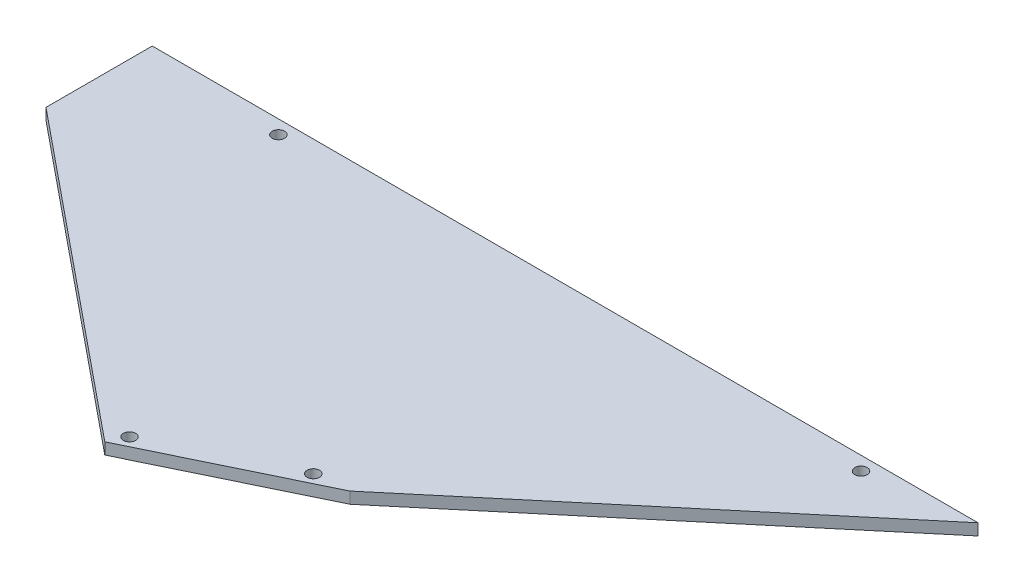
ISO-10303-21;
HEADER;
FILE_DESCRIPTION(('STEP AP214'),'2;1');
FILE_NAME('part.step','',(''),(''),'','','');
FILE_SCHEMA(('AUTOMOTIVE_DESIGN { 1 0 10303 214 1 1 1 1 }'));
ENDSEC;
DATA;
#1=APPLICATION_CONTEXT('core data for automotive mechanical design processes');
#2=APPLICATION_PROTOCOL_DEFINITION('international standard','automotive_design',2000,#1);
#3=PRODUCT_CONTEXT('',#1,'mechanical');
#4=PRODUCT('Part','Part','',(#3));
#5=PRODUCT_RELATED_PRODUCT_CATEGORY('part','',(#4));
#6=PRODUCT_DEFINITION_FORMATION('','',#4);
#7=PRODUCT_DEFINITION_CONTEXT('part definition',#1,'design');
#8=PRODUCT_DEFINITION('design','',#6,#7);
#9=PRODUCT_DEFINITION_SHAPE('','',#8);
#10=(LENGTH_UNIT() NAMED_UNIT(*) SI_UNIT(.MILLI.,.METRE.));
#11=(NAMED_UNIT(*) PLANE_ANGLE_UNIT() SI_UNIT($,.RADIAN.));
#12=(NAMED_UNIT(*) SI_UNIT($,.STERADIAN.) SOLID_ANGLE_UNIT());
#13=UNCERTAINTY_MEASURE_WITH_UNIT(LENGTH_MEASURE(1.E-05),#10,'distance_accuracy_value','');
#14=(GEOMETRIC_REPRESENTATION_CONTEXT(3) GLOBAL_UNCERTAINTY_ASSIGNED_CONTEXT((#13)) GLOBAL_UNIT_ASSIGNED_CONTEXT((#10,
#11,#12)) REPRESENTATION_CONTEXT('',''));
#15=CARTESIAN_POINT('',(0.,0.,0.));
#16=DIRECTION('',(0.,0.,1.));
#17=DIRECTION('',(1.,0.,0.));
#18=AXIS2_PLACEMENT_3D('',#15,#16,#17);
#19=CARTESIAN_POINT('',(0.,6.35,0.));
#20=DIRECTION('',(0.,-1.,0.));
#21=DIRECTION('',(0.,0.,-1.));
#22=AXIS2_PLACEMENT_3D('',#19,#20,#21);
#23=PLANE('',#22);
#24=DIRECTION('',(0.766044443118981,0.,-0.642787609686535));
#25=VECTOR('',#24,1.);
#26=CARTESIAN_POINT('',(-189.093207010109,6.35,158.66804026031));
#27=LINE('',#26,#25);
#28=CARTESIAN_POINT('',(-189.093207010109,6.35,158.66804026031));
#29=VERTEX_POINT('',#28);
#30=CARTESIAN_POINT('',(0.,6.35,0.));
#31=VERTEX_POINT('',#30);
#32=EDGE_CURVE('E136',#29,#31,#27,.T.);
#33=ORIENTED_EDGE('',*,*,#32,.T.);
#34=DIRECTION('',(-1.,0.,0.));
#35=VECTOR('',#34,1.);
#36=CARTESIAN_POINT('',(0.,6.35,0.));
#37=LINE('',#36,#35);
#38=CARTESIAN_POINT('',(-457.2,6.35,0.));
#39=VERTEX_POINT('',#38);
#40=EDGE_CURVE('E90',#31,#39,#37,.T.);
#41=ORIENTED_EDGE('',*,*,#40,.T.);
#42=DIRECTION('',(0.,0.,1.));
#43=VECTOR('',#42,1.);
#44=CARTESIAN_POINT('',(-457.2,6.35,58.8227919457594));
#45=LINE('',#44,#43);
#46=CARTESIAN_POINT('',(-457.2,6.35,58.8227919457594));
#47=VERTEX_POINT('',#46);
#48=EDGE_CURVE('E94',#39,#47,#45,.T.);
#49=ORIENTED_EDGE('',*,*,#48,.T.);
#50=DIRECTION('',(0.774894485136974,0.,0.632090608144358));
#51=VECTOR('',#50,1.);
#52=CARTESIAN_POINT('',(-457.2,6.35,58.8227919457594));
#53=LINE('',#52,#51);
#54=CARTESIAN_POINT('',(-280.55117869575,6.35,202.917327431388));
#55=VERTEX_POINT('',#54);
#56=EDGE_CURVE('E98',#47,#55,#53,.T.);
#57=ORIENTED_EDGE('',*,*,#56,.T.);
#58=DIRECTION('',(0.900176886669692,0.,-0.435524480030297));
#59=VECTOR('',#58,1.);
#60=CARTESIAN_POINT('',(-189.093207010109,6.35,158.66804026031));
#61=LINE('',#60,#59);
#62=EDGE_CURVE('E56',#55,#29,#61,.T.);
#63=ORIENTED_EDGE('',*,*,#62,.T.);
#64=EDGE_LOOP('',(#33,#41,#49,#57,#63));
#65=FACE_BOUND('',#64,.T.);
#66=CARTESIAN_POINT('',(-207.494657953148,6.35,160.516879503369));
#67=DIRECTION('',(0.,1.,0.));
#68=DIRECTION('',(0.,0.,1.));
#69=AXIS2_PLACEMENT_3D('',#66,#67,#68);
#70=CIRCLE('',#69,3.42900000000095);
#71=CARTESIAN_POINT('',(-207.494657953148,6.35,163.94587950337));
#72=VERTEX_POINT('',#71);
#73=EDGE_CURVE('E125',#72,#72,#70,.T.);
#74=ORIENTED_EDGE('',*,*,#73,.F.);
#75=EDGE_LOOP('',(#74));
#76=FACE_BOUND('',#75,.T.);
#77=CARTESIAN_POINT('',(-276.088136717378,6.35,193.703844881678));
#78=DIRECTION('',(0.,1.,0.));
#79=DIRECTION('',(0.,0.,1.));
#80=AXIS2_PLACEMENT_3D('',#77,#78,#79);
#81=CIRCLE('',#80,3.42900000000081);
#82=CARTESIAN_POINT('',(-276.088136717378,6.35,197.132844881679));
#83=VERTEX_POINT('',#82);
#84=EDGE_CURVE('E135',#83,#83,#81,.T.);
#85=ORIENTED_EDGE('',*,*,#84,.F.);
#86=EDGE_LOOP('',(#85));
#87=FACE_BOUND('',#86,.T.);
#88=CARTESIAN_POINT('',(-57.15,6.35,7.62000000000005));
#89=DIRECTION('',(0.,1.,0.));
#90=DIRECTION('',(0.,0.,1.));
#91=AXIS2_PLACEMENT_3D('',#88,#89,#90);
#92=CIRCLE('',#91,3.429);
#93=CARTESIAN_POINT('',(-57.15,6.35,11.0490000000001));
#94=VERTEX_POINT('',#93);
#95=EDGE_CURVE('E199',#94,#94,#92,.T.);
#96=ORIENTED_EDGE('',*,*,#95,.F.);
#97=EDGE_LOOP('',(#96));
#98=FACE_BOUND('',#97,.T.);
#99=CARTESIAN_POINT('',(-379.73,6.35,7.62000000000005));
#100=DIRECTION('',(0.,1.,0.));
#101=DIRECTION('',(0.,0.,1.));
#102=AXIS2_PLACEMENT_3D('',#99,#100,#101);
#103=CIRCLE('',#102,3.429);
#104=CARTESIAN_POINT('',(-379.73,6.35,11.0490000000001));
#105=VERTEX_POINT('',#104);
#106=EDGE_CURVE('E190',#105,#105,#103,.T.);
#107=ORIENTED_EDGE('',*,*,#106,.F.);
#108=EDGE_LOOP('',(#107));
#109=FACE_BOUND('',#108,.T.);
#110=ADVANCED_FACE('F39',(#65,#76,#87,#98,#109),#23,.F.);
#111=CARTESIAN_POINT('',(0.,0.,0.));
#112=DIRECTION('',(0.,-1.,0.));
#113=DIRECTION('',(0.,0.,-1.));
#114=AXIS2_PLACEMENT_3D('',#111,#112,#113);
#115=PLANE('',#114);
#116=CARTESIAN_POINT('',(-57.15,0.,7.62000000000005));
#117=DIRECTION('',(0.,1.,0.));
#118=DIRECTION('',(0.,0.,1.));
#119=AXIS2_PLACEMENT_3D('',#116,#117,#118);
#120=CIRCLE('',#119,3.429);
#121=CARTESIAN_POINT('',(-57.15,0.,11.0490000000001));
#122=VERTEX_POINT('',#121);
#123=EDGE_CURVE('E196',#122,#122,#120,.T.);
#124=ORIENTED_EDGE('',*,*,#123,.T.);
#125=EDGE_LOOP('',(#124));
#126=FACE_BOUND('',#125,.T.);
#127=CARTESIAN_POINT('',(-207.494657953148,0.,160.516879503369));
#128=DIRECTION('',(0.,1.,0.));
#129=DIRECTION('',(0.,0.,1.));
#130=AXIS2_PLACEMENT_3D('',#127,#128,#129);
#131=CIRCLE('',#130,3.42900000000095);
#132=CARTESIAN_POINT('',(-207.494657953148,0.,163.94587950337));
#133=VERTEX_POINT('',#132);
#134=EDGE_CURVE('E131',#133,#133,#131,.T.);
#135=ORIENTED_EDGE('',*,*,#134,.T.);
#136=EDGE_LOOP('',(#135));
#137=FACE_BOUND('',#136,.T.);
#138=DIRECTION('',(0.766044443118981,0.,-0.642787609686535));
#139=VECTOR('',#138,1.);
#140=CARTESIAN_POINT('',(-189.093207010109,0.,158.66804026031));
#141=LINE('',#140,#139);
#142=CARTESIAN_POINT('',(-189.093207010109,0.,158.66804026031));
#143=VERTEX_POINT('',#142);
#144=CARTESIAN_POINT('',(0.,0.,0.));
#145=VERTEX_POINT('',#144);
#146=EDGE_CURVE('E130',#143,#145,#141,.T.);
#147=ORIENTED_EDGE('',*,*,#146,.F.);
#148=DIRECTION('',(0.900176886669692,0.,-0.435524480030297));
#149=VECTOR('',#148,1.);
#150=CARTESIAN_POINT('',(-189.093207010109,0.,158.66804026031));
#151=LINE('',#150,#149);
#152=CARTESIAN_POINT('',(-280.55117869575,0.,202.917327431388));
#153=VERTEX_POINT('',#152);
#154=EDGE_CURVE('E82',#153,#143,#151,.T.);
#155=ORIENTED_EDGE('',*,*,#154,.F.);
#156=DIRECTION('',(0.774894485136974,0.,0.632090608144358));
#157=VECTOR('',#156,1.);
#158=CARTESIAN_POINT('',(-457.2,0.,58.8227919457594));
#159=LINE('',#158,#157);
#160=CARTESIAN_POINT('',(-457.2,0.,58.8227919457594));
#161=VERTEX_POINT('',#160);
#162=EDGE_CURVE('E76',#161,#153,#159,.T.);
#163=ORIENTED_EDGE('',*,*,#162,.F.);
#164=DIRECTION('',(0.,0.,1.));
#165=VECTOR('',#164,1.);
#166=CARTESIAN_POINT('',(-457.2,0.,58.8227919457594));
#167=LINE('',#166,#165);
#168=CARTESIAN_POINT('',(-457.2,0.,0.));
#169=VERTEX_POINT('',#168);
#170=EDGE_CURVE('E105',#169,#161,#167,.T.);
#171=ORIENTED_EDGE('',*,*,#170,.F.);
#172=DIRECTION('',(-1.,0.,0.));
#173=VECTOR('',#172,1.);
#174=CARTESIAN_POINT('',(0.,0.,0.));
#175=LINE('',#174,#173);
#176=EDGE_CURVE('E151',#145,#169,#175,.T.);
#177=ORIENTED_EDGE('',*,*,#176,.F.);
#178=EDGE_LOOP('',(#147,#155,#163,#171,#177));
#179=FACE_BOUND('',#178,.T.);
#180=CARTESIAN_POINT('',(-276.088136717378,0.,193.703844881678));
#181=DIRECTION('',(0.,1.,0.));
#182=DIRECTION('',(0.,0.,1.));
#183=AXIS2_PLACEMENT_3D('',#180,#181,#182);
#184=CIRCLE('',#183,3.42900000000081);
#185=CARTESIAN_POINT('',(-276.088136717378,0.,197.132844881679));
#186=VERTEX_POINT('',#185);
#187=EDGE_CURVE('E132',#186,#186,#184,.T.);
#188=ORIENTED_EDGE('',*,*,#187,.T.);
#189=EDGE_LOOP('',(#188));
#190=FACE_BOUND('',#189,.T.);
#191=CARTESIAN_POINT('',(-379.73,0.,7.62000000000005));
#192=DIRECTION('',(0.,1.,0.));
#193=DIRECTION('',(0.,0.,1.));
#194=AXIS2_PLACEMENT_3D('',#191,#192,#193);
#195=CIRCLE('',#194,3.429);
#196=CARTESIAN_POINT('',(-379.73,0.,11.0490000000001));
#197=VERTEX_POINT('',#196);
#198=EDGE_CURVE('E193',#197,#197,#195,.T.);
#199=ORIENTED_EDGE('',*,*,#198,.T.);
#200=EDGE_LOOP('',(#199));
#201=FACE_BOUND('',#200,.T.);
#202=ADVANCED_FACE('F149',(#126,#137,#179,#190,#201),#115,.T.);
#203=CARTESIAN_POINT('',(-189.093207010109,6.35,158.66804026031));
#204=DIRECTION('',(-0.642787609686535,0.,-0.766044443118982));
#205=DIRECTION('',(-0.766044443118982,0.,0.642787609686535));
#206=AXIS2_PLACEMENT_3D('',#203,#204,#205);
#207=PLANE('',#206);
#208=ORIENTED_EDGE('',*,*,#146,.T.);
#209=DIRECTION('',(0.,-1.,0.));
#210=VECTOR('',#209,1.);
#211=CARTESIAN_POINT('',(0.,6.35,0.));
#212=LINE('',#211,#210);
#213=EDGE_CURVE('E12',#31,#145,#212,.T.);
#214=ORIENTED_EDGE('',*,*,#213,.F.);
#215=ORIENTED_EDGE('',*,*,#32,.F.);
#216=DIRECTION('',(0.,-1.,0.));
#217=VECTOR('',#216,1.);
#218=CARTESIAN_POINT('',(-189.093207010109,6.35,158.66804026031));
#219=LINE('',#218,#217);
#220=EDGE_CURVE('E110',#29,#143,#219,.T.);
#221=ORIENTED_EDGE('',*,*,#220,.T.);
#222=EDGE_LOOP('',(#208,#214,#215,#221));
#223=FACE_BOUND('',#222,.T.);
#224=ADVANCED_FACE('F41',(#223),#207,.F.);
#225=CARTESIAN_POINT('',(0.,6.35,0.));
#226=DIRECTION('',(0.,0.,1.));
#227=DIRECTION('',(1.,0.,0.));
#228=AXIS2_PLACEMENT_3D('',#225,#226,#227);
#229=PLANE('',#228);
#230=ORIENTED_EDGE('',*,*,#176,.T.);
#231=DIRECTION('',(0.,-1.,0.));
#232=VECTOR('',#231,1.);
#233=CARTESIAN_POINT('',(-457.2,6.35,0.));
#234=LINE('',#233,#232);
#235=EDGE_CURVE('E48',#39,#169,#234,.T.);
#236=ORIENTED_EDGE('',*,*,#235,.F.);
#237=ORIENTED_EDGE('',*,*,#40,.F.);
#238=ORIENTED_EDGE('',*,*,#213,.T.);
#239=EDGE_LOOP('',(#230,#236,#237,#238));
#240=FACE_BOUND('',#239,.T.);
#241=ADVANCED_FACE('F250',(#240),#229,.F.);
#242=CARTESIAN_POINT('',(-457.2,6.35,58.8227919457594));
#243=DIRECTION('',(1.,0.,0.));
#244=DIRECTION('',(0.,0.,-1.));
#245=AXIS2_PLACEMENT_3D('',#242,#243,#244);
#246=PLANE('',#245);
#247=ORIENTED_EDGE('',*,*,#170,.T.);
#248=DIRECTION('',(0.,-1.,0.));
#249=VECTOR('',#248,1.);
#250=CARTESIAN_POINT('',(-457.2,6.35,58.8227919457594));
#251=LINE('',#250,#249);
#252=EDGE_CURVE('E102',#47,#161,#251,.T.);
#253=ORIENTED_EDGE('',*,*,#252,.F.);
#254=ORIENTED_EDGE('',*,*,#48,.F.);
#255=ORIENTED_EDGE('',*,*,#235,.T.);
#256=EDGE_LOOP('',(#247,#253,#254,#255));
#257=FACE_BOUND('',#256,.T.);
#258=ADVANCED_FACE('F103',(#257),#246,.F.);
#259=CARTESIAN_POINT('',(-457.2,6.35,58.8227919457594));
#260=DIRECTION('',(0.632090608144358,0.,-0.774894485136973));
#261=DIRECTION('',(-0.774894485136974,0.,-0.632090608144358));
#262=AXIS2_PLACEMENT_3D('',#259,#260,#261);
#263=PLANE('',#262);
#264=ORIENTED_EDGE('',*,*,#162,.T.);
#265=DIRECTION('',(0.,-1.,0.));
#266=VECTOR('',#265,1.);
#267=CARTESIAN_POINT('',(-280.55117869575,6.35,202.917327431388));
#268=LINE('',#267,#266);
#269=EDGE_CURVE('E106',#55,#153,#268,.T.);
#270=ORIENTED_EDGE('',*,*,#269,.F.);
#271=ORIENTED_EDGE('',*,*,#56,.F.);
#272=ORIENTED_EDGE('',*,*,#252,.T.);
#273=EDGE_LOOP('',(#264,#270,#271,#272));
#274=FACE_BOUND('',#273,.T.);
#275=ADVANCED_FACE('F108',(#274),#263,.F.);
#276=CARTESIAN_POINT('',(-189.093207010109,6.35,158.66804026031));
#277=DIRECTION('',(-0.435524480030297,0.,-0.900176886669692));
#278=DIRECTION('',(-0.900176886669692,0.,0.435524480030297));
#279=AXIS2_PLACEMENT_3D('',#276,#277,#278);
#280=PLANE('',#279);
#281=ORIENTED_EDGE('',*,*,#154,.T.);
#282=ORIENTED_EDGE('',*,*,#220,.F.);
#283=ORIENTED_EDGE('',*,*,#62,.F.);
#284=ORIENTED_EDGE('',*,*,#269,.T.);
#285=EDGE_LOOP('',(#281,#282,#283,#284));
#286=FACE_BOUND('',#285,.T.);
#287=ADVANCED_FACE('F155',(#286),#280,.F.);
#288=CARTESIAN_POINT('',(-207.494657953148,6.35,160.516879503369));
#289=DIRECTION('',(0.,-1.,0.));
#290=DIRECTION('',(0.,0.,-1.));
#291=AXIS2_PLACEMENT_3D('',#288,#289,#290);
#292=CYLINDRICAL_SURFACE('',#291,3.42900000000095);
#293=ORIENTED_EDGE('',*,*,#73,.T.);
#294=EDGE_LOOP('',(#293));
#295=FACE_BOUND('',#294,.T.);
#296=ORIENTED_EDGE('',*,*,#134,.F.);
#297=EDGE_LOOP('',(#296));
#298=FACE_BOUND('',#297,.T.);
#299=ADVANCED_FACE('F157',(#295,#298),#292,.F.);
#300=CARTESIAN_POINT('',(-276.088136717378,6.35,193.703844881678));
#301=DIRECTION('',(0.,-1.,0.));
#302=DIRECTION('',(0.,0.,-1.));
#303=AXIS2_PLACEMENT_3D('',#300,#301,#302);
#304=CYLINDRICAL_SURFACE('',#303,3.42900000000081);
#305=ORIENTED_EDGE('',*,*,#84,.T.);
#306=EDGE_LOOP('',(#305));
#307=FACE_BOUND('',#306,.T.);
#308=ORIENTED_EDGE('',*,*,#187,.F.);
#309=EDGE_LOOP('',(#308));
#310=FACE_BOUND('',#309,.T.);
#311=ADVANCED_FACE('F163',(#307,#310),#304,.F.);
#312=CARTESIAN_POINT('',(-57.15,6.35,7.62000000000005));
#313=DIRECTION('',(0.,-1.,0.));
#314=DIRECTION('',(0.,0.,-1.));
#315=AXIS2_PLACEMENT_3D('',#312,#313,#314);
#316=CYLINDRICAL_SURFACE('',#315,3.429);
#317=ORIENTED_EDGE('',*,*,#95,.T.);
#318=EDGE_LOOP('',(#317));
#319=FACE_BOUND('',#318,.T.);
#320=ORIENTED_EDGE('',*,*,#123,.F.);
#321=EDGE_LOOP('',(#320));
#322=FACE_BOUND('',#321,.T.);
#323=ADVANCED_FACE('F177',(#319,#322),#316,.F.);
#324=CARTESIAN_POINT('',(-379.73,6.35,7.62000000000005));
#325=DIRECTION('',(0.,-1.,0.));
#326=DIRECTION('',(0.,0.,-1.));
#327=AXIS2_PLACEMENT_3D('',#324,#325,#326);
#328=CYLINDRICAL_SURFACE('',#327,3.429);
#329=ORIENTED_EDGE('',*,*,#106,.T.);
#330=EDGE_LOOP('',(#329));
#331=FACE_BOUND('',#330,.T.);
#332=ORIENTED_EDGE('',*,*,#198,.F.);
#333=EDGE_LOOP('',(#332));
#334=FACE_BOUND('',#333,.T.);
#335=ADVANCED_FACE('F181',(#331,#334),#328,.F.);
#336=CLOSED_SHELL('',(#110,#202,#224,#241,#258,#275,#287,#299,#311,#323,#335));
#337=MANIFOLD_SOLID_BREP('B2',#336);
#338=ADVANCED_BREP_SHAPE_REPRESENTATION('',(#18,#337),#14);
#339=SHAPE_DEFINITION_REPRESENTATION(#9,#338);
ENDSEC;
END-ISO-10303-21;
